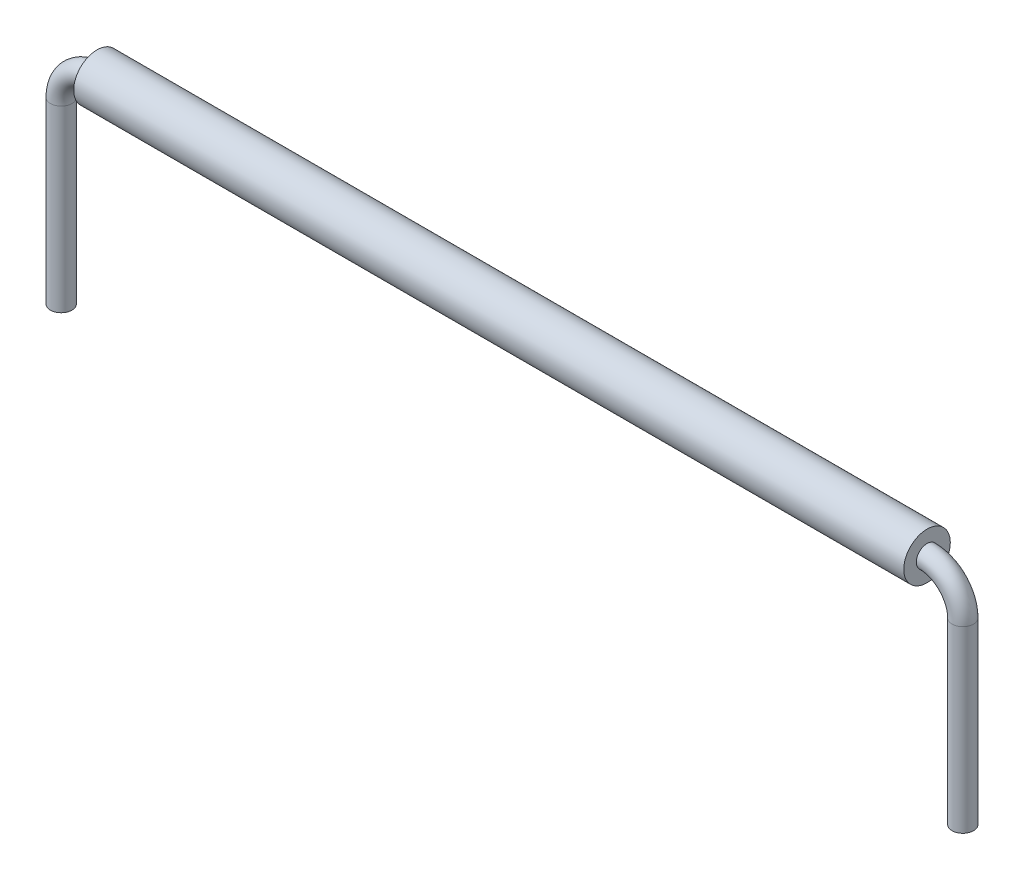
ISO-10303-21;
HEADER;
FILE_DESCRIPTION(('STEP AP214'),'2;1');
FILE_NAME('part.step','',(''),(''),'','','');
FILE_SCHEMA(('AUTOMOTIVE_DESIGN { 1 0 10303 214 1 1 1 1 }'));
ENDSEC;
DATA;
#1=APPLICATION_CONTEXT('core data for automotive mechanical design processes');
#2=APPLICATION_PROTOCOL_DEFINITION('international standard','automotive_design',2000,#1);
#3=PRODUCT_CONTEXT('',#1,'mechanical');
#4=PRODUCT('Part','Part','',(#3));
#5=PRODUCT_RELATED_PRODUCT_CATEGORY('part','',(#4));
#6=PRODUCT_DEFINITION_FORMATION('','',#4);
#7=PRODUCT_DEFINITION_CONTEXT('part definition',#1,'design');
#8=PRODUCT_DEFINITION('design','',#6,#7);
#9=PRODUCT_DEFINITION_SHAPE('','',#8);
#10=(LENGTH_UNIT() NAMED_UNIT(*) SI_UNIT(.MILLI.,.METRE.));
#11=(NAMED_UNIT(*) PLANE_ANGLE_UNIT() SI_UNIT($,.RADIAN.));
#12=(NAMED_UNIT(*) SI_UNIT($,.STERADIAN.) SOLID_ANGLE_UNIT());
#13=UNCERTAINTY_MEASURE_WITH_UNIT(LENGTH_MEASURE(1.E-05),#10,'distance_accuracy_value','');
#14=(GEOMETRIC_REPRESENTATION_CONTEXT(3) GLOBAL_UNCERTAINTY_ASSIGNED_CONTEXT((#13)) GLOBAL_UNIT_ASSIGNED_CONTEXT((#10,
#11,#12)) REPRESENTATION_CONTEXT('',''));
#15=CARTESIAN_POINT('',(0.,0.,0.));
#16=DIRECTION('',(0.,0.,1.));
#17=DIRECTION('',(1.,0.,0.));
#18=AXIS2_PLACEMENT_3D('',#15,#16,#17);
#19=CARTESIAN_POINT('',(11.596,0.,0.));
#20=DIRECTION('',(1.,0.,0.));
#21=DIRECTION('',(0.,0.,-1.));
#22=AXIS2_PLACEMENT_3D('',#19,#20,#21);
#23=PLANE('',#22);
#24=CARTESIAN_POINT('',(11.596,0.,0.));
#25=DIRECTION('',(1.,0.,0.));
#26=DIRECTION('',(0.,0.,-1.));
#27=AXIS2_PLACEMENT_3D('',#24,#25,#26);
#28=CIRCLE('',#27,0.65);
#29=CARTESIAN_POINT('',(11.596,0.,-0.65));
#30=VERTEX_POINT('',#29);
#31=EDGE_CURVE('E11',#30,#30,#28,.T.);
#32=ORIENTED_EDGE('',*,*,#31,.T.);
#33=EDGE_LOOP('',(#32));
#34=FACE_BOUND('',#33,.T.);
#35=CARTESIAN_POINT('',(11.596,0.,0.));
#36=DIRECTION('',(1.,0.,0.));
#37=DIRECTION('',(0.,0.,-1.));
#38=AXIS2_PLACEMENT_3D('',#35,#36,#37);
#39=CIRCLE('',#38,0.3);
#40=CARTESIAN_POINT('',(11.596,0.,-0.3));
#41=VERTEX_POINT('',#40);
#42=EDGE_CURVE('E52',#41,#41,#39,.T.);
#43=ORIENTED_EDGE('',*,*,#42,.F.);
#44=EDGE_LOOP('',(#43));
#45=FACE_BOUND('',#44,.T.);
#46=ADVANCED_FACE('F45',(#34,#45),#23,.T.);
#47=CARTESIAN_POINT('',(11.596,0.,0.));
#48=DIRECTION('',(-1.,0.,0.));
#49=DIRECTION('',(0.,0.,1.));
#50=AXIS2_PLACEMENT_3D('',#47,#48,#49);
#51=CYLINDRICAL_SURFACE('',#50,0.65);
#52=ORIENTED_EDGE('',*,*,#31,.F.);
#53=EDGE_LOOP('',(#52));
#54=FACE_BOUND('',#53,.T.);
#55=CARTESIAN_POINT('',(-11.596,0.,0.));
#56=DIRECTION('',(1.,0.,0.));
#57=DIRECTION('',(0.,0.,-1.));
#58=AXIS2_PLACEMENT_3D('',#55,#56,#57);
#59=CIRCLE('',#58,0.65);
#60=CARTESIAN_POINT('',(-11.596,0.,-0.65));
#61=VERTEX_POINT('',#60);
#62=EDGE_CURVE('E56',#61,#61,#59,.T.);
#63=ORIENTED_EDGE('',*,*,#62,.T.);
#64=EDGE_LOOP('',(#63));
#65=FACE_BOUND('',#64,.T.);
#66=ADVANCED_FACE('F47',(#54,#65),#51,.T.);
#67=CARTESIAN_POINT('',(11.596,0.,0.));
#68=DIRECTION('',(-1.,0.,0.));
#69=DIRECTION('',(0.,0.,1.));
#70=AXIS2_PLACEMENT_3D('',#67,#68,#69);
#71=CYLINDRICAL_SURFACE('',#70,0.3);
#72=ORIENTED_EDGE('',*,*,#42,.T.);
#73=EDGE_LOOP('',(#72));
#74=FACE_BOUND('',#73,.T.);
#75=CARTESIAN_POINT('',(-11.596,0.,0.));
#76=DIRECTION('',(1.,0.,0.));
#77=DIRECTION('',(0.,0.,-1.));
#78=AXIS2_PLACEMENT_3D('',#75,#76,#77);
#79=CIRCLE('',#78,0.3);
#80=CARTESIAN_POINT('',(-11.596,0.,-0.3));
#81=VERTEX_POINT('',#80);
#82=EDGE_CURVE('E60',#81,#81,#79,.T.);
#83=ORIENTED_EDGE('',*,*,#82,.F.);
#84=EDGE_LOOP('',(#83));
#85=FACE_BOUND('',#84,.T.);
#86=ADVANCED_FACE('F69',(#74,#85),#71,.F.);
#87=CARTESIAN_POINT('',(-11.596,0.,0.));
#88=DIRECTION('',(1.,0.,0.));
#89=DIRECTION('',(0.,0.,-1.));
#90=AXIS2_PLACEMENT_3D('',#87,#88,#89);
#91=PLANE('',#90);
#92=ORIENTED_EDGE('',*,*,#82,.T.);
#93=EDGE_LOOP('',(#92));
#94=FACE_BOUND('',#93,.T.);
#95=ORIENTED_EDGE('',*,*,#62,.F.);
#96=EDGE_LOOP('',(#95));
#97=FACE_BOUND('',#96,.T.);
#98=ADVANCED_FACE('F66',(#94,#97),#91,.F.);
#99=CLOSED_SHELL('',(#46,#66,#86,#98));
#100=MANIFOLD_SOLID_BREP('B2',#99);
#101=CARTESIAN_POINT('',(12.596,-6.,0.));
#102=DIRECTION('',(0.,-1.,0.));
#103=DIRECTION('',(0.,0.,-1.));
#104=AXIS2_PLACEMENT_3D('',#101,#102,#103);
#105=PLANE('',#104);
#106=CARTESIAN_POINT('',(12.596,-6.,0.));
#107=DIRECTION('',(0.,-1.,0.));
#108=DIRECTION('',(0.,0.,-1.));
#109=AXIS2_PLACEMENT_3D('',#106,#107,#108);
#110=CIRCLE('',#109,0.3);
#111=CARTESIAN_POINT('',(12.596,-6.,-0.3));
#112=VERTEX_POINT('',#111);
#113=EDGE_CURVE('E129',#112,#112,#110,.T.);
#114=ORIENTED_EDGE('',*,*,#113,.T.);
#115=EDGE_LOOP('',(#114));
#116=FACE_BOUND('',#115,.T.);
#117=ADVANCED_FACE('F107',(#116),#105,.T.);
#118=CARTESIAN_POINT('',(-12.596,-6.,0.));
#119=DIRECTION('',(0.,1.,0.));
#120=DIRECTION('',(0.,0.,-1.));
#121=AXIS2_PLACEMENT_3D('',#118,#119,#120);
#122=PLANE('',#121);
#123=CARTESIAN_POINT('',(-12.596,-6.,0.));
#124=DIRECTION('',(0.,1.,0.));
#125=DIRECTION('',(0.,0.,-1.));
#126=AXIS2_PLACEMENT_3D('',#123,#124,#125);
#127=CIRCLE('',#126,0.3);
#128=CARTESIAN_POINT('',(-12.596,-6.,-0.3));
#129=VERTEX_POINT('',#128);
#130=EDGE_CURVE('E44',#129,#129,#127,.T.);
#131=ORIENTED_EDGE('',*,*,#130,.F.);
#132=EDGE_LOOP('',(#131));
#133=FACE_BOUND('',#132,.T.);
#134=ADVANCED_FACE('F137',(#133),#122,.F.);
#135=CARTESIAN_POINT('',(12.596,-6.,0.));
#136=DIRECTION('',(0.,1.,0.));
#137=DIRECTION('',(0.,0.,1.));
#138=AXIS2_PLACEMENT_3D('',#135,#136,#137);
#139=CYLINDRICAL_SURFACE('',#138,0.3);
#140=CARTESIAN_POINT('',(12.596,-0.999999999999997,0.));
#141=DIRECTION('',(0.,-1.,0.));
#142=DIRECTION('',(0.,0.,-1.));
#143=AXIS2_PLACEMENT_3D('',#140,#141,#142);
#144=CIRCLE('',#143,0.3);
#145=CARTESIAN_POINT('',(12.896,-0.999999999999997,0.));
#146=VERTEX_POINT('',#145);
#147=EDGE_CURVE('E126',#146,#146,#144,.T.);
#148=ORIENTED_EDGE('',*,*,#147,.T.);
#149=EDGE_LOOP('',(#148));
#150=FACE_BOUND('',#149,.T.);
#151=ORIENTED_EDGE('',*,*,#113,.F.);
#152=EDGE_LOOP('',(#151));
#153=FACE_BOUND('',#152,.T.);
#154=ADVANCED_FACE('F134',(#150,#153),#139,.T.);
#155=CARTESIAN_POINT('',(11.596,-0.999999999999997,0.));
#156=DIRECTION('',(0.,0.,1.));
#157=DIRECTION('',(1.,0.,0.));
#158=AXIS2_PLACEMENT_3D('',#155,#156,#157);
#159=TOROIDAL_SURFACE('',#158,0.999999999999999,0.3);
#160=CARTESIAN_POINT('',(11.596,0.,0.));
#161=DIRECTION('',(1.,0.,0.));
#162=DIRECTION('',(0.,0.,-1.));
#163=AXIS2_PLACEMENT_3D('',#160,#161,#162);
#164=CIRCLE('',#163,0.3);
#165=CARTESIAN_POINT('',(11.596,0.300000000000002,0.));
#166=VERTEX_POINT('',#165);
#167=EDGE_CURVE('E121',#166,#166,#164,.T.);
#168=CARTESIAN_POINT('',(11.596,-0.999999999999997,0.));
#169=DIRECTION('',(0.,0.,1.));
#170=DIRECTION('',(1.,0.,0.));
#171=AXIS2_PLACEMENT_3D('',#168,#169,#170);
#172=CIRCLE('',#171,1.3);
#173=EDGE_CURVE('',#146,#166,#172,.T.);
#174=ORIENTED_EDGE('',*,*,#147,.F.);
#175=ORIENTED_EDGE('',*,*,#167,.T.);
#176=ORIENTED_EDGE('',*,*,#173,.T.);
#177=ORIENTED_EDGE('',*,*,#173,.F.);
#178=EDGE_LOOP('',(#174,#176,#175,#177));
#179=FACE_BOUND('',#178,.T.);
#180=ADVANCED_FACE('F136',(#179),#159,.T.);
#181=CARTESIAN_POINT('',(11.596,0.,0.));
#182=DIRECTION('',(-1.,0.,0.));
#183=DIRECTION('',(0.,-1.,0.));
#184=AXIS2_PLACEMENT_3D('',#181,#182,#183);
#185=CYLINDRICAL_SURFACE('',#184,0.3);
#186=CARTESIAN_POINT('',(-11.596,0.,0.));
#187=DIRECTION('',(1.,0.,0.));
#188=DIRECTION('',(0.,0.,-1.));
#189=AXIS2_PLACEMENT_3D('',#186,#187,#188);
#190=CIRCLE('',#189,0.3);
#191=CARTESIAN_POINT('',(-11.596,0.299999999999999,0.));
#192=VERTEX_POINT('',#191);
#193=EDGE_CURVE('E117',#192,#192,#190,.T.);
#194=ORIENTED_EDGE('',*,*,#193,.T.);
#195=EDGE_LOOP('',(#194));
#196=FACE_BOUND('',#195,.T.);
#197=ORIENTED_EDGE('',*,*,#167,.F.);
#198=EDGE_LOOP('',(#197));
#199=FACE_BOUND('',#198,.T.);
#200=ADVANCED_FACE('F144',(#196,#199),#185,.T.);
#201=CARTESIAN_POINT('',(-11.596,-1.,0.));
#202=DIRECTION('',(0.,0.,1.));
#203=DIRECTION('',(1.,0.,0.));
#204=AXIS2_PLACEMENT_3D('',#201,#202,#203);
#205=TOROIDAL_SURFACE('',#204,0.999999999999999,0.3);
#206=CARTESIAN_POINT('',(-12.596,-1.,0.));
#207=DIRECTION('',(0.,1.,0.));
#208=DIRECTION('',(0.,0.,-1.));
#209=AXIS2_PLACEMENT_3D('',#206,#207,#208);
#210=CIRCLE('',#209,0.3);
#211=CARTESIAN_POINT('',(-12.896,-1.,0.));
#212=VERTEX_POINT('',#211);
#213=EDGE_CURVE('E113',#212,#212,#210,.T.);
#214=CARTESIAN_POINT('',(-11.596,-1.,0.));
#215=DIRECTION('',(0.,0.,1.));
#216=DIRECTION('',(1.,0.,0.));
#217=AXIS2_PLACEMENT_3D('',#214,#215,#216);
#218=CIRCLE('',#217,1.3);
#219=EDGE_CURVE('',#192,#212,#218,.T.);
#220=ORIENTED_EDGE('',*,*,#193,.F.);
#221=ORIENTED_EDGE('',*,*,#213,.T.);
#222=ORIENTED_EDGE('',*,*,#219,.T.);
#223=ORIENTED_EDGE('',*,*,#219,.F.);
#224=EDGE_LOOP('',(#220,#222,#221,#223));
#225=FACE_BOUND('',#224,.T.);
#226=ADVANCED_FACE('F150',(#225),#205,.T.);
#227=CARTESIAN_POINT('',(-12.596,-1.,0.));
#228=DIRECTION('',(0.,-1.,0.));
#229=DIRECTION('',(0.,0.,-1.));
#230=AXIS2_PLACEMENT_3D('',#227,#228,#229);
#231=CYLINDRICAL_SURFACE('',#230,0.3);
#232=ORIENTED_EDGE('',*,*,#130,.T.);
#233=EDGE_LOOP('',(#232));
#234=FACE_BOUND('',#233,.T.);
#235=ORIENTED_EDGE('',*,*,#213,.F.);
#236=EDGE_LOOP('',(#235));
#237=FACE_BOUND('',#236,.T.);
#238=ADVANCED_FACE('F148',(#234,#237),#231,.T.);
#239=CLOSED_SHELL('',(#117,#134,#154,#180,#200,#226,#238));
#240=MANIFOLD_SOLID_BREP('B6',#239);
#241=ADVANCED_BREP_SHAPE_REPRESENTATION('',(#18,#100,#240),#14);
#242=SHAPE_DEFINITION_REPRESENTATION(#9,#241);
ENDSEC;
END-ISO-10303-21;
